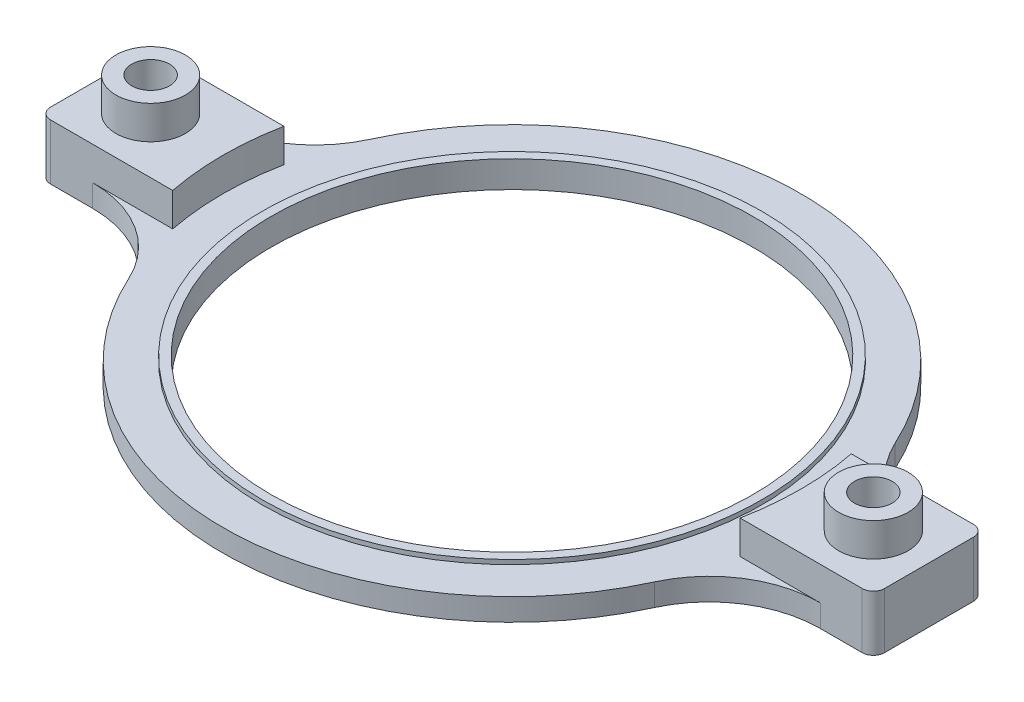
ISO-10303-21;
HEADER;
FILE_DESCRIPTION(('STEP AP214'),'2;1');
FILE_NAME('part.step','',(''),(''),'','','');
FILE_SCHEMA(('AUTOMOTIVE_DESIGN { 1 0 10303 214 1 1 1 1 }'));
ENDSEC;
DATA;
#1=APPLICATION_CONTEXT('core data for automotive mechanical design processes');
#2=APPLICATION_PROTOCOL_DEFINITION('international standard','automotive_design',2000,#1);
#3=PRODUCT_CONTEXT('',#1,'mechanical');
#4=PRODUCT('Part','Part','',(#3));
#5=PRODUCT_RELATED_PRODUCT_CATEGORY('part','',(#4));
#6=PRODUCT_DEFINITION_FORMATION('','',#4);
#7=PRODUCT_DEFINITION_CONTEXT('part definition',#1,'design');
#8=PRODUCT_DEFINITION('design','',#6,#7);
#9=PRODUCT_DEFINITION_SHAPE('','',#8);
#10=(LENGTH_UNIT() NAMED_UNIT(*) SI_UNIT(.MILLI.,.METRE.));
#11=(NAMED_UNIT(*) PLANE_ANGLE_UNIT() SI_UNIT($,.RADIAN.));
#12=(NAMED_UNIT(*) SI_UNIT($,.STERADIAN.) SOLID_ANGLE_UNIT());
#13=UNCERTAINTY_MEASURE_WITH_UNIT(LENGTH_MEASURE(1.E-05),#10,'distance_accuracy_value','');
#14=(GEOMETRIC_REPRESENTATION_CONTEXT(3) GLOBAL_UNCERTAINTY_ASSIGNED_CONTEXT((#13)) GLOBAL_UNIT_ASSIGNED_CONTEXT((#10,
#11,#12)) REPRESENTATION_CONTEXT('',''));
#15=CARTESIAN_POINT('',(0.,0.,0.));
#16=DIRECTION('',(0.,0.,1.));
#17=DIRECTION('',(1.,0.,0.));
#18=AXIS2_PLACEMENT_3D('',#15,#16,#17);
#19=CARTESIAN_POINT('',(0.,2.,0.));
#20=DIRECTION('',(0.,-1.,0.));
#21=DIRECTION('',(0.,0.,-1.));
#22=AXIS2_PLACEMENT_3D('',#19,#20,#21);
#23=CYLINDRICAL_SURFACE('',#22,26.);
#24=CARTESIAN_POINT('',(0.,0.,0.));
#25=DIRECTION('',(0.,1.,0.));
#26=DIRECTION('',(0.,0.,1.));
#27=AXIS2_PLACEMENT_3D('',#24,#25,#26);
#28=CIRCLE('',#27,26.);
#29=CARTESIAN_POINT('',(23.635542915044,0.,-10.8333333333333));
#30=VERTEX_POINT('',#29);
#31=CARTESIAN_POINT('',(-23.635542915044,0.,-10.8333333333333));
#32=VERTEX_POINT('',#31);
#33=EDGE_CURVE('E344',#30,#32,#28,.T.);
#34=ORIENTED_EDGE('',*,*,#33,.T.);
#35=DIRECTION('',(0.,-1.,0.));
#36=VECTOR('',#35,1.);
#37=CARTESIAN_POINT('',(-23.6355429150441,2.,-10.8333333333333));
#38=LINE('',#37,#36);
#39=CARTESIAN_POINT('',(-23.635542915044,2.,-10.8333333333333));
#40=VERTEX_POINT('',#39);
#41=EDGE_CURVE('E404',#32,#40,#38,.F.);
#42=ORIENTED_EDGE('',*,*,#41,.T.);
#43=CARTESIAN_POINT('',(0.,2.,0.));
#44=DIRECTION('',(0.,1.,0.));
#45=DIRECTION('',(0.,0.,1.));
#46=AXIS2_PLACEMENT_3D('',#43,#44,#45);
#47=CIRCLE('',#46,26.);
#48=CARTESIAN_POINT('',(23.635542915044,2.,-10.8333333333333));
#49=VERTEX_POINT('',#48);
#50=EDGE_CURVE('E342',#49,#40,#47,.T.);
#51=ORIENTED_EDGE('',*,*,#50,.F.);
#52=DIRECTION('',(0.,-1.,0.));
#53=VECTOR('',#52,1.);
#54=CARTESIAN_POINT('',(23.6355429150441,2.,-10.8333333333333));
#55=LINE('',#54,#53);
#56=EDGE_CURVE('E400',#49,#30,#55,.T.);
#57=ORIENTED_EDGE('',*,*,#56,.T.);
#58=EDGE_LOOP('',(#34,#42,#51,#57));
#59=FACE_BOUND('',#58,.T.);
#60=ADVANCED_FACE('F47',(#59),#23,.T.);
#61=CARTESIAN_POINT('',(-23.635542915044,2.,10.8333333333333));
#62=VERTEX_POINT('',#61);
#63=CARTESIAN_POINT('',(23.635542915044,2.,10.8333333333333));
#64=VERTEX_POINT('',#63);
#65=EDGE_CURVE('E348',#62,#64,#47,.T.);
#66=ORIENTED_EDGE('',*,*,#65,.F.);
#67=DIRECTION('',(0.,-1.,0.));
#68=VECTOR('',#67,1.);
#69=CARTESIAN_POINT('',(-23.6355429150441,2.,10.8333333333333));
#70=LINE('',#69,#68);
#71=CARTESIAN_POINT('',(-23.635542915044,0.,10.8333333333333));
#72=VERTEX_POINT('',#71);
#73=EDGE_CURVE('E391',#62,#72,#70,.T.);
#74=ORIENTED_EDGE('',*,*,#73,.T.);
#75=CARTESIAN_POINT('',(23.635542915044,0.,10.8333333333333));
#76=VERTEX_POINT('',#75);
#77=EDGE_CURVE('E339',#72,#76,#28,.T.);
#78=ORIENTED_EDGE('',*,*,#77,.T.);
#79=DIRECTION('',(0.,-1.,0.));
#80=VECTOR('',#79,1.);
#81=CARTESIAN_POINT('',(23.6355429150441,2.,10.8333333333333));
#82=LINE('',#81,#80);
#83=EDGE_CURVE('E387',#76,#64,#82,.F.);
#84=ORIENTED_EDGE('',*,*,#83,.T.);
#85=EDGE_LOOP('',(#66,#74,#78,#84));
#86=FACE_BOUND('',#85,.T.);
#87=ADVANCED_FACE('F450',(#86),#23,.T.);
#88=CARTESIAN_POINT('',(0.,2.,0.));
#89=DIRECTION('',(0.,1.,0.));
#90=DIRECTION('',(0.,0.,1.));
#91=AXIS2_PLACEMENT_3D('',#88,#89,#90);
#92=PLANE('',#91);
#93=CARTESIAN_POINT('',(25.5147016443462,2.,5.));
#94=VERTEX_POINT('',#93);
#95=CARTESIAN_POINT('',(25.5147016443462,2.,-5.));
#96=VERTEX_POINT('',#95);
#97=EDGE_CURVE('E260',#94,#96,#47,.T.);
#98=ORIENTED_EDGE('',*,*,#97,.T.);
#99=DIRECTION('',(-1.,0.,0.));
#100=VECTOR('',#99,1.);
#101=CARTESIAN_POINT('',(0.,2.,-5.));
#102=LINE('',#101,#100);
#103=CARTESIAN_POINT('',(32.7261363439072,2.,-5.));
#104=VERTEX_POINT('',#103);
#105=EDGE_CURVE('E407',#104,#96,#102,.T.);
#106=ORIENTED_EDGE('',*,*,#105,.F.);
#107=CARTESIAN_POINT('',(32.7261363439072,2.,-15.));
#108=DIRECTION('',(0.,1.,0.));
#109=DIRECTION('',(0.,0.,1.));
#110=AXIS2_PLACEMENT_3D('',#107,#108,#109);
#111=CIRCLE('',#110,10.);
#112=EDGE_CURVE('E430',#104,#49,#111,.F.);
#113=ORIENTED_EDGE('',*,*,#112,.T.);
#114=ORIENTED_EDGE('',*,*,#50,.T.);
#115=CARTESIAN_POINT('',(-32.7261363439072,2.,-15.));
#116=DIRECTION('',(0.,1.,0.));
#117=DIRECTION('',(0.,0.,1.));
#118=AXIS2_PLACEMENT_3D('',#115,#116,#117);
#119=CIRCLE('',#118,10.);
#120=CARTESIAN_POINT('',(-32.7261363439072,2.,-5.));
#121=VERTEX_POINT('',#120);
#122=EDGE_CURVE('E426',#40,#121,#119,.F.);
#123=ORIENTED_EDGE('',*,*,#122,.T.);
#124=DIRECTION('',(-1.,0.,0.));
#125=VECTOR('',#124,1.);
#126=CARTESIAN_POINT('',(-25.5147016443462,2.,-5.));
#127=LINE('',#126,#125);
#128=CARTESIAN_POINT('',(-25.5147016443462,2.,-5.));
#129=VERTEX_POINT('',#128);
#130=EDGE_CURVE('E70',#129,#121,#127,.T.);
#131=ORIENTED_EDGE('',*,*,#130,.F.);
#132=CARTESIAN_POINT('',(-25.5147016443462,2.,5.));
#133=VERTEX_POINT('',#132);
#134=EDGE_CURVE('E343',#129,#133,#47,.T.);
#135=ORIENTED_EDGE('',*,*,#134,.T.);
#136=DIRECTION('',(1.,0.,0.));
#137=VECTOR('',#136,1.);
#138=CARTESIAN_POINT('',(-25.5147016443462,2.,5.));
#139=LINE('',#138,#137);
#140=CARTESIAN_POINT('',(-32.7261363439072,2.,5.));
#141=VERTEX_POINT('',#140);
#142=EDGE_CURVE('E209',#141,#133,#139,.T.);
#143=ORIENTED_EDGE('',*,*,#142,.F.);
#144=CARTESIAN_POINT('',(-32.7261363439072,2.,15.));
#145=DIRECTION('',(0.,1.,0.));
#146=DIRECTION('',(0.,0.,1.));
#147=AXIS2_PLACEMENT_3D('',#144,#145,#146);
#148=CIRCLE('',#147,10.);
#149=EDGE_CURVE('E417',#141,#62,#148,.F.);
#150=ORIENTED_EDGE('',*,*,#149,.T.);
#151=ORIENTED_EDGE('',*,*,#65,.T.);
#152=CARTESIAN_POINT('',(32.7261363439072,2.,15.));
#153=DIRECTION('',(0.,1.,0.));
#154=DIRECTION('',(0.,0.,1.));
#155=AXIS2_PLACEMENT_3D('',#152,#153,#154);
#156=CIRCLE('',#155,10.);
#157=CARTESIAN_POINT('',(32.7261363439072,2.,5.));
#158=VERTEX_POINT('',#157);
#159=EDGE_CURVE('E56',#64,#158,#156,.F.);
#160=ORIENTED_EDGE('',*,*,#159,.T.);
#161=DIRECTION('',(1.,0.,0.));
#162=VECTOR('',#161,1.);
#163=CARTESIAN_POINT('',(0.,2.,5.));
#164=LINE('',#163,#162);
#165=EDGE_CURVE('E63',#94,#158,#164,.T.);
#166=ORIENTED_EDGE('',*,*,#165,.F.);
#167=EDGE_LOOP('',(#98,#106,#113,#114,#123,#131,#135,#143,#150,#151,#160,#166));
#168=FACE_BOUND('',#167,.T.);
#169=CARTESIAN_POINT('',(0.,2.,0.));
#170=DIRECTION('',(0.,1.,0.));
#171=DIRECTION('',(0.,0.,1.));
#172=AXIS2_PLACEMENT_3D('',#169,#170,#171);
#173=CIRCLE('',#172,22.475);
#174=CARTESIAN_POINT('',(0.,2.,22.475));
#175=VERTEX_POINT('',#174);
#176=EDGE_CURVE('E327',#175,#175,#173,.T.);
#177=ORIENTED_EDGE('',*,*,#176,.F.);
#178=EDGE_LOOP('',(#177));
#179=FACE_BOUND('',#178,.T.);
#180=ADVANCED_FACE('F434',(#168,#179),#92,.T.);
#181=CARTESIAN_POINT('',(0.,0.,0.));
#182=DIRECTION('',(0.,1.,0.));
#183=DIRECTION('',(0.,0.,1.));
#184=AXIS2_PLACEMENT_3D('',#181,#182,#183);
#185=PLANE('',#184);
#186=ORIENTED_EDGE('',*,*,#33,.F.);
#187=CARTESIAN_POINT('',(32.7261363439072,0.,-15.));
#188=DIRECTION('',(0.,1.,0.));
#189=DIRECTION('',(0.,0.,1.));
#190=AXIS2_PLACEMENT_3D('',#187,#188,#189);
#191=CIRCLE('',#190,10.);
#192=CARTESIAN_POINT('',(32.7261363439072,0.,-5.));
#193=VERTEX_POINT('',#192);
#194=EDGE_CURVE('E193',#30,#193,#191,.T.);
#195=ORIENTED_EDGE('',*,*,#194,.T.);
#196=DIRECTION('',(1.,0.,0.));
#197=VECTOR('',#196,1.);
#198=CARTESIAN_POINT('',(25.5147016443462,0.,-5.));
#199=LINE('',#198,#197);
#200=CARTESIAN_POINT('',(36.5000016443461,0.,-5.));
#201=VERTEX_POINT('',#200);
#202=EDGE_CURVE('E185',#193,#201,#199,.T.);
#203=ORIENTED_EDGE('',*,*,#202,.T.);
#204=CARTESIAN_POINT('',(36.5000016443461,0.,-4.));
#205=DIRECTION('',(0.,-1.,0.));
#206=DIRECTION('',(0.,0.,-1.));
#207=AXIS2_PLACEMENT_3D('',#204,#205,#206);
#208=CIRCLE('',#207,1.);
#209=CARTESIAN_POINT('',(37.5000016443461,0.,-4.));
#210=VERTEX_POINT('',#209);
#211=EDGE_CURVE('E192',#201,#210,#208,.T.);
#212=ORIENTED_EDGE('',*,*,#211,.T.);
#213=DIRECTION('',(0.,0.,1.));
#214=VECTOR('',#213,1.);
#215=CARTESIAN_POINT('',(37.5000016443461,0.,-4.));
#216=LINE('',#215,#214);
#217=CARTESIAN_POINT('',(37.5000016443461,0.,4.));
#218=VERTEX_POINT('',#217);
#219=EDGE_CURVE('E218',#210,#218,#216,.T.);
#220=ORIENTED_EDGE('',*,*,#219,.T.);
#221=CARTESIAN_POINT('',(36.5000016443461,0.,4.));
#222=DIRECTION('',(0.,-1.,0.));
#223=DIRECTION('',(0.,0.,-1.));
#224=AXIS2_PLACEMENT_3D('',#221,#222,#223);
#225=CIRCLE('',#224,1.);
#226=CARTESIAN_POINT('',(36.5000016443461,0.,5.));
#227=VERTEX_POINT('',#226);
#228=EDGE_CURVE('E227',#218,#227,#225,.T.);
#229=ORIENTED_EDGE('',*,*,#228,.T.);
#230=DIRECTION('',(-1.,0.,0.));
#231=VECTOR('',#230,1.);
#232=CARTESIAN_POINT('',(25.5147016443462,0.,5.));
#233=LINE('',#232,#231);
#234=CARTESIAN_POINT('',(32.7261363439072,0.,5.));
#235=VERTEX_POINT('',#234);
#236=EDGE_CURVE('E198',#227,#235,#233,.T.);
#237=ORIENTED_EDGE('',*,*,#236,.T.);
#238=CARTESIAN_POINT('',(32.7261363439072,0.,15.));
#239=DIRECTION('',(0.,1.,0.));
#240=DIRECTION('',(0.,0.,1.));
#241=AXIS2_PLACEMENT_3D('',#238,#239,#240);
#242=CIRCLE('',#241,10.);
#243=EDGE_CURVE('E11',#235,#76,#242,.T.);
#244=ORIENTED_EDGE('',*,*,#243,.T.);
#245=ORIENTED_EDGE('',*,*,#77,.F.);
#246=CARTESIAN_POINT('',(-32.7261363439072,0.,15.));
#247=DIRECTION('',(0.,1.,0.));
#248=DIRECTION('',(0.,0.,1.));
#249=AXIS2_PLACEMENT_3D('',#246,#247,#248);
#250=CIRCLE('',#249,10.);
#251=CARTESIAN_POINT('',(-32.7261363439072,0.,5.));
#252=VERTEX_POINT('',#251);
#253=EDGE_CURVE('E420',#72,#252,#250,.T.);
#254=ORIENTED_EDGE('',*,*,#253,.T.);
#255=DIRECTION('',(1.,0.,0.));
#256=VECTOR('',#255,1.);
#257=CARTESIAN_POINT('',(-25.5147016443462,0.,5.));
#258=LINE('',#257,#256);
#259=CARTESIAN_POINT('',(-36.5000016443461,0.,5.));
#260=VERTEX_POINT('',#259);
#261=EDGE_CURVE('E264',#260,#252,#258,.T.);
#262=ORIENTED_EDGE('',*,*,#261,.F.);
#263=CARTESIAN_POINT('',(-36.5000016443461,0.,4.));
#264=DIRECTION('',(0.,-1.,0.));
#265=DIRECTION('',(0.,0.,-1.));
#266=AXIS2_PLACEMENT_3D('',#263,#264,#265);
#267=CIRCLE('',#266,1.);
#268=CARTESIAN_POINT('',(-37.5000016443461,0.,4.));
#269=VERTEX_POINT('',#268);
#270=EDGE_CURVE('E234',#260,#269,#267,.T.);
#271=ORIENTED_EDGE('',*,*,#270,.T.);
#272=DIRECTION('',(0.,0.,-1.));
#273=VECTOR('',#272,1.);
#274=CARTESIAN_POINT('',(-37.5000016443461,0.,4.));
#275=LINE('',#274,#273);
#276=CARTESIAN_POINT('',(-37.5000016443461,0.,-4.));
#277=VERTEX_POINT('',#276);
#278=EDGE_CURVE('E238',#269,#277,#275,.T.);
#279=ORIENTED_EDGE('',*,*,#278,.T.);
#280=CARTESIAN_POINT('',(-36.5000016443461,0.,-4.));
#281=DIRECTION('',(0.,-1.,0.));
#282=DIRECTION('',(0.,0.,-1.));
#283=AXIS2_PLACEMENT_3D('',#280,#281,#282);
#284=CIRCLE('',#283,1.);
#285=CARTESIAN_POINT('',(-36.5000016443461,0.,-5.));
#286=VERTEX_POINT('',#285);
#287=EDGE_CURVE('E242',#277,#286,#284,.T.);
#288=ORIENTED_EDGE('',*,*,#287,.T.);
#289=DIRECTION('',(-1.,0.,0.));
#290=VECTOR('',#289,1.);
#291=CARTESIAN_POINT('',(-25.5147016443462,0.,-5.));
#292=LINE('',#291,#290);
#293=CARTESIAN_POINT('',(-32.7261363439072,0.,-5.));
#294=VERTEX_POINT('',#293);
#295=EDGE_CURVE('E270',#294,#286,#292,.T.);
#296=ORIENTED_EDGE('',*,*,#295,.F.);
#297=CARTESIAN_POINT('',(-32.7261363439072,0.,-15.));
#298=DIRECTION('',(0.,1.,0.));
#299=DIRECTION('',(0.,0.,1.));
#300=AXIS2_PLACEMENT_3D('',#297,#298,#299);
#301=CIRCLE('',#300,10.);
#302=EDGE_CURVE('E423',#294,#32,#301,.T.);
#303=ORIENTED_EDGE('',*,*,#302,.T.);
#304=EDGE_LOOP('',(#186,#195,#203,#212,#220,#229,#237,#244,#245,#254,#262,#271,#279,#288,#296,#303));
#305=FACE_BOUND('',#304,.T.);
#306=CARTESIAN_POINT('',(0.,0.,0.));
#307=DIRECTION('',(0.,1.,0.));
#308=DIRECTION('',(0.,0.,1.));
#309=AXIS2_PLACEMENT_3D('',#306,#307,#308);
#310=CIRCLE('',#309,21.675);
#311=CARTESIAN_POINT('',(0.,0.,21.675));
#312=VERTEX_POINT('',#311);
#313=EDGE_CURVE('E332',#312,#312,#310,.T.);
#314=ORIENTED_EDGE('',*,*,#313,.T.);
#315=EDGE_LOOP('',(#314));
#316=FACE_BOUND('',#315,.T.);
#317=CARTESIAN_POINT('',(-32.5000016443461,0.,0.));
#318=DIRECTION('',(0.,-1.,0.));
#319=DIRECTION('',(0.,0.,-1.));
#320=AXIS2_PLACEMENT_3D('',#317,#318,#319);
#321=CIRCLE('',#320,1.7);
#322=CARTESIAN_POINT('',(-32.5000016443461,0.,-1.7));
#323=VERTEX_POINT('',#322);
#324=EDGE_CURVE('E224',#323,#323,#321,.T.);
#325=ORIENTED_EDGE('',*,*,#324,.F.);
#326=EDGE_LOOP('',(#325));
#327=FACE_BOUND('',#326,.T.);
#328=CARTESIAN_POINT('',(32.5000016443461,0.,0.));
#329=DIRECTION('',(0.,-1.,0.));
#330=DIRECTION('',(0.,0.,-1.));
#331=AXIS2_PLACEMENT_3D('',#328,#329,#330);
#332=CIRCLE('',#331,1.7);
#333=CARTESIAN_POINT('',(32.5000016443461,0.,-1.7));
#334=VERTEX_POINT('',#333);
#335=EDGE_CURVE('E217',#334,#334,#332,.T.);
#336=ORIENTED_EDGE('',*,*,#335,.F.);
#337=EDGE_LOOP('',(#336));
#338=FACE_BOUND('',#337,.T.);
#339=ADVANCED_FACE('F188',(#305,#316,#327,#338),#185,.F.);
#340=CARTESIAN_POINT('',(0.,2.,0.));
#341=DIRECTION('',(0.,-1.,0.));
#342=DIRECTION('',(0.,0.,-1.));
#343=AXIS2_PLACEMENT_3D('',#340,#341,#342);
#344=CYLINDRICAL_SURFACE('',#343,21.675);
#345=ORIENTED_EDGE('',*,*,#313,.F.);
#346=EDGE_LOOP('',(#345));
#347=FACE_BOUND('',#346,.T.);
#348=CARTESIAN_POINT('',(0.,2.4,0.));
#349=DIRECTION('',(0.,1.,0.));
#350=DIRECTION('',(0.,0.,1.));
#351=AXIS2_PLACEMENT_3D('',#348,#349,#350);
#352=CIRCLE('',#351,21.675);
#353=CARTESIAN_POINT('',(0.,2.4,21.675));
#354=VERTEX_POINT('',#353);
#355=EDGE_CURVE('E320',#354,#354,#352,.T.);
#356=ORIENTED_EDGE('',*,*,#355,.T.);
#357=EDGE_LOOP('',(#356));
#358=FACE_BOUND('',#357,.T.);
#359=ADVANCED_FACE('F572',(#347,#358),#344,.F.);
#360=CARTESIAN_POINT('',(0.,2.4,0.));
#361=DIRECTION('',(0.,1.,0.));
#362=DIRECTION('',(0.,0.,1.));
#363=AXIS2_PLACEMENT_3D('',#360,#361,#362);
#364=PLANE('',#363);
#365=CARTESIAN_POINT('',(0.,2.4,0.));
#366=DIRECTION('',(0.,1.,0.));
#367=DIRECTION('',(0.,0.,1.));
#368=AXIS2_PLACEMENT_3D('',#365,#366,#367);
#369=CIRCLE('',#368,22.475);
#370=CARTESIAN_POINT('',(0.,2.4,22.475));
#371=VERTEX_POINT('',#370);
#372=EDGE_CURVE('E328',#371,#371,#369,.T.);
#373=ORIENTED_EDGE('',*,*,#372,.T.);
#374=EDGE_LOOP('',(#373));
#375=FACE_BOUND('',#374,.T.);
#376=ORIENTED_EDGE('',*,*,#355,.F.);
#377=EDGE_LOOP('',(#376));
#378=FACE_BOUND('',#377,.T.);
#379=ADVANCED_FACE('F569',(#375,#378),#364,.T.);
#380=CARTESIAN_POINT('',(0.,2.4,0.));
#381=DIRECTION('',(0.,-1.,0.));
#382=DIRECTION('',(0.,0.,-1.));
#383=AXIS2_PLACEMENT_3D('',#380,#381,#382);
#384=CYLINDRICAL_SURFACE('',#383,22.475);
#385=ORIENTED_EDGE('',*,*,#372,.F.);
#386=EDGE_LOOP('',(#385));
#387=FACE_BOUND('',#386,.T.);
#388=ORIENTED_EDGE('',*,*,#176,.T.);
#389=EDGE_LOOP('',(#388));
#390=FACE_BOUND('',#389,.T.);
#391=ADVANCED_FACE('F568',(#387,#390),#384,.T.);
#392=CARTESIAN_POINT('',(0.,5.,0.));
#393=DIRECTION('',(0.,-1.,0.));
#394=DIRECTION('',(0.,0.,-1.));
#395=AXIS2_PLACEMENT_3D('',#392,#393,#394);
#396=CYLINDRICAL_SURFACE('',#395,26.);
#397=DIRECTION('',(0.,-1.,0.));
#398=VECTOR('',#397,1.);
#399=CARTESIAN_POINT('',(25.5147016443462,5.,-5.));
#400=LINE('',#399,#398);
#401=CARTESIAN_POINT('',(25.5147016443462,5.,-5.));
#402=VERTEX_POINT('',#401);
#403=EDGE_CURVE('E312',#402,#96,#400,.T.);
#404=ORIENTED_EDGE('',*,*,#403,.T.);
#405=ORIENTED_EDGE('',*,*,#97,.F.);
#406=DIRECTION('',(0.,-1.,0.));
#407=VECTOR('',#406,1.);
#408=CARTESIAN_POINT('',(25.5147016443462,5.,5.));
#409=LINE('',#408,#407);
#410=CARTESIAN_POINT('',(25.5147016443462,5.,5.));
#411=VERTEX_POINT('',#410);
#412=EDGE_CURVE('E317',#411,#94,#409,.T.);
#413=ORIENTED_EDGE('',*,*,#412,.F.);
#414=CARTESIAN_POINT('',(0.,5.,0.));
#415=DIRECTION('',(0.,1.,0.));
#416=DIRECTION('',(0.,0.,-1.));
#417=AXIS2_PLACEMENT_3D('',#414,#415,#416);
#418=CIRCLE('',#417,26.);
#419=EDGE_CURVE('E304',#411,#402,#418,.T.);
#420=ORIENTED_EDGE('',*,*,#419,.T.);
#421=EDGE_LOOP('',(#404,#405,#413,#420));
#422=FACE_BOUND('',#421,.T.);
#423=ADVANCED_FACE('F536',(#422),#396,.F.);
#424=CARTESIAN_POINT('',(25.5147016443462,5.,5.));
#425=DIRECTION('',(0.,0.,1.));
#426=DIRECTION('',(1.,0.,0.));
#427=AXIS2_PLACEMENT_3D('',#424,#425,#426);
#428=PLANE('',#427);
#429=ORIENTED_EDGE('',*,*,#412,.T.);
#430=ORIENTED_EDGE('',*,*,#165,.T.);
#431=DIRECTION('',(0.,-1.,0.));
#432=VECTOR('',#431,1.);
#433=CARTESIAN_POINT('',(32.7261363439072,5.,5.));
#434=LINE('',#433,#432);
#435=EDGE_CURVE('E413',#158,#235,#434,.T.);
#436=ORIENTED_EDGE('',*,*,#435,.T.);
#437=ORIENTED_EDGE('',*,*,#236,.F.);
#438=DIRECTION('',(0.,-1.,0.));
#439=VECTOR('',#438,1.);
#440=CARTESIAN_POINT('',(36.5000016443461,5.,5.));
#441=LINE('',#440,#439);
#442=CARTESIAN_POINT('',(36.5000016443461,5.,5.));
#443=VERTEX_POINT('',#442);
#444=EDGE_CURVE('E373',#227,#443,#441,.F.);
#445=ORIENTED_EDGE('',*,*,#444,.T.);
#446=DIRECTION('',(-1.,0.,0.));
#447=VECTOR('',#446,1.);
#448=CARTESIAN_POINT('',(25.5147016443462,5.,5.));
#449=LINE('',#448,#447);
#450=EDGE_CURVE('E310',#443,#411,#449,.T.);
#451=ORIENTED_EDGE('',*,*,#450,.T.);
#452=EDGE_LOOP('',(#429,#430,#436,#437,#445,#451));
#453=FACE_BOUND('',#452,.T.);
#454=ADVANCED_FACE('F441',(#453),#428,.T.);
#455=CARTESIAN_POINT('',(25.5147016443462,5.,-5.));
#456=DIRECTION('',(0.,0.,-1.));
#457=DIRECTION('',(-1.,0.,0.));
#458=AXIS2_PLACEMENT_3D('',#455,#456,#457);
#459=PLANE('',#458);
#460=ORIENTED_EDGE('',*,*,#202,.F.);
#461=DIRECTION('',(0.,-1.,0.));
#462=VECTOR('',#461,1.);
#463=CARTESIAN_POINT('',(32.7261363439072,5.,-5.));
#464=LINE('',#463,#462);
#465=EDGE_CURVE('E410',#193,#104,#464,.F.);
#466=ORIENTED_EDGE('',*,*,#465,.T.);
#467=ORIENTED_EDGE('',*,*,#105,.T.);
#468=ORIENTED_EDGE('',*,*,#403,.F.);
#469=DIRECTION('',(1.,0.,0.));
#470=VECTOR('',#469,1.);
#471=CARTESIAN_POINT('',(25.5147016443462,5.,-5.));
#472=LINE('',#471,#470);
#473=CARTESIAN_POINT('',(36.5000016443461,5.,-5.));
#474=VERTEX_POINT('',#473);
#475=EDGE_CURVE('E206',#402,#474,#472,.T.);
#476=ORIENTED_EDGE('',*,*,#475,.T.);
#477=DIRECTION('',(0.,1.,0.));
#478=VECTOR('',#477,1.);
#479=CARTESIAN_POINT('',(36.5000016443461,5.,-5.));
#480=LINE('',#479,#478);
#481=EDGE_CURVE('E203',#474,#201,#480,.F.);
#482=ORIENTED_EDGE('',*,*,#481,.T.);
#483=EDGE_LOOP('',(#460,#466,#467,#468,#476,#482));
#484=FACE_BOUND('',#483,.T.);
#485=ADVANCED_FACE('F204',(#484),#459,.T.);
#486=CARTESIAN_POINT('',(0.,5.,0.));
#487=DIRECTION('',(0.,-1.,0.));
#488=DIRECTION('',(0.,0.,-1.));
#489=AXIS2_PLACEMENT_3D('',#486,#487,#488);
#490=PLANE('',#489);
#491=CARTESIAN_POINT('',(32.5000016443461,5.,0.));
#492=DIRECTION('',(0.,-1.,0.));
#493=DIRECTION('',(0.,0.,-1.));
#494=AXIS2_PLACEMENT_3D('',#491,#492,#493);
#495=CIRCLE('',#494,3.125);
#496=CARTESIAN_POINT('',(32.5000016443461,5.,-3.125));
#497=VERTEX_POINT('',#496);
#498=EDGE_CURVE('E297',#497,#497,#495,.T.);
#499=ORIENTED_EDGE('',*,*,#498,.T.);
#500=EDGE_LOOP('',(#499));
#501=FACE_BOUND('',#500,.T.);
#502=ORIENTED_EDGE('',*,*,#450,.F.);
#503=CARTESIAN_POINT('',(36.5000016443461,5.,4.));
#504=DIRECTION('',(0.,-1.,0.));
#505=DIRECTION('',(0.,0.,-1.));
#506=AXIS2_PLACEMENT_3D('',#503,#504,#505);
#507=CIRCLE('',#506,1.);
#508=CARTESIAN_POINT('',(37.5000016443461,5.,4.));
#509=VERTEX_POINT('',#508);
#510=EDGE_CURVE('E210',#443,#509,#507,.F.);
#511=ORIENTED_EDGE('',*,*,#510,.T.);
#512=DIRECTION('',(0.,0.,1.));
#513=VECTOR('',#512,1.);
#514=CARTESIAN_POINT('',(37.5000016443461,5.,-5.));
#515=LINE('',#514,#513);
#516=CARTESIAN_POINT('',(37.5000016443461,5.,-4.));
#517=VERTEX_POINT('',#516);
#518=EDGE_CURVE('E199',#517,#509,#515,.T.);
#519=ORIENTED_EDGE('',*,*,#518,.F.);
#520=CARTESIAN_POINT('',(36.5000016443461,5.,-4.));
#521=DIRECTION('',(0.,-1.,0.));
#522=DIRECTION('',(0.,0.,-1.));
#523=AXIS2_PLACEMENT_3D('',#520,#521,#522);
#524=CIRCLE('',#523,1.);
#525=EDGE_CURVE('E376',#517,#474,#524,.F.);
#526=ORIENTED_EDGE('',*,*,#525,.T.);
#527=ORIENTED_EDGE('',*,*,#475,.F.);
#528=ORIENTED_EDGE('',*,*,#419,.F.);
#529=EDGE_LOOP('',(#502,#511,#519,#526,#527,#528));
#530=FACE_BOUND('',#529,.T.);
#531=ADVANCED_FACE('F540',(#501,#530),#490,.F.);
#532=CARTESIAN_POINT('',(37.5000016443461,0.,0.));
#533=DIRECTION('',(1.,0.,0.));
#534=DIRECTION('',(0.,0.,-1.));
#535=AXIS2_PLACEMENT_3D('',#532,#533,#534);
#536=PLANE('',#535);
#537=ORIENTED_EDGE('',*,*,#518,.T.);
#538=DIRECTION('',(0.,-1.,0.));
#539=VECTOR('',#538,1.);
#540=CARTESIAN_POINT('',(37.5000016443461,0.,4.));
#541=LINE('',#540,#539);
#542=EDGE_CURVE('E370',#509,#218,#541,.T.);
#543=ORIENTED_EDGE('',*,*,#542,.T.);
#544=ORIENTED_EDGE('',*,*,#219,.F.);
#545=DIRECTION('',(0.,1.,0.));
#546=VECTOR('',#545,1.);
#547=CARTESIAN_POINT('',(37.5000016443461,0.,-4.));
#548=LINE('',#547,#546);
#549=EDGE_CURVE('E214',#210,#517,#548,.T.);
#550=ORIENTED_EDGE('',*,*,#549,.T.);
#551=EDGE_LOOP('',(#537,#543,#544,#550));
#552=FACE_BOUND('',#551,.T.);
#553=ADVANCED_FACE('F544',(#552),#536,.T.);
#554=CARTESIAN_POINT('',(32.5000016443461,8.,0.));
#555=DIRECTION('',(0.,-1.,0.));
#556=DIRECTION('',(0.,0.,-1.));
#557=AXIS2_PLACEMENT_3D('',#554,#555,#556);
#558=CYLINDRICAL_SURFACE('',#557,3.125);
#559=CARTESIAN_POINT('',(32.5000016443461,8.,0.));
#560=DIRECTION('',(0.,-1.,0.));
#561=DIRECTION('',(0.,0.,-1.));
#562=AXIS2_PLACEMENT_3D('',#559,#560,#561);
#563=CIRCLE('',#562,3.125);
#564=CARTESIAN_POINT('',(32.5000016443461,8.,-3.125));
#565=VERTEX_POINT('',#564);
#566=EDGE_CURVE('E293',#565,#565,#563,.T.);
#567=ORIENTED_EDGE('',*,*,#566,.T.);
#568=EDGE_LOOP('',(#567));
#569=FACE_BOUND('',#568,.T.);
#570=ORIENTED_EDGE('',*,*,#498,.F.);
#571=EDGE_LOOP('',(#570));
#572=FACE_BOUND('',#571,.T.);
#573=ADVANCED_FACE('F550',(#569,#572),#558,.T.);
#574=CARTESIAN_POINT('',(32.5000016443461,8.,0.));
#575=DIRECTION('',(0.,-1.,0.));
#576=DIRECTION('',(0.,0.,-1.));
#577=AXIS2_PLACEMENT_3D('',#574,#575,#576);
#578=PLANE('',#577);
#579=CARTESIAN_POINT('',(32.5000016443461,8.,0.));
#580=DIRECTION('',(0.,-1.,0.));
#581=DIRECTION('',(0.,0.,-1.));
#582=AXIS2_PLACEMENT_3D('',#579,#580,#581);
#583=CIRCLE('',#582,1.7);
#584=CARTESIAN_POINT('',(32.5000016443461,8.,-1.7));
#585=VERTEX_POINT('',#584);
#586=EDGE_CURVE('E286',#585,#585,#583,.T.);
#587=ORIENTED_EDGE('',*,*,#586,.T.);
#588=EDGE_LOOP('',(#587));
#589=FACE_BOUND('',#588,.T.);
#590=ORIENTED_EDGE('',*,*,#566,.F.);
#591=EDGE_LOOP('',(#590));
#592=FACE_BOUND('',#591,.T.);
#593=ADVANCED_FACE('F555',(#589,#592),#578,.F.);
#594=CARTESIAN_POINT('',(32.5000016443461,3.,0.));
#595=DIRECTION('',(0.,-1.,0.));
#596=DIRECTION('',(0.,0.,-1.));
#597=AXIS2_PLACEMENT_3D('',#594,#595,#596);
#598=CYLINDRICAL_SURFACE('',#597,1.7);
#599=ORIENTED_EDGE('',*,*,#586,.F.);
#600=EDGE_LOOP('',(#599));
#601=FACE_BOUND('',#600,.T.);
#602=ORIENTED_EDGE('',*,*,#335,.T.);
#603=EDGE_LOOP('',(#602));
#604=FACE_BOUND('',#603,.T.);
#605=ADVANCED_FACE('F633',(#601,#604),#598,.F.);
#606=CARTESIAN_POINT('',(0.,5.,0.));
#607=DIRECTION('',(0.,-1.,0.));
#608=DIRECTION('',(0.,0.,-1.));
#609=AXIS2_PLACEMENT_3D('',#606,#607,#608);
#610=CYLINDRICAL_SURFACE('',#609,26.);
#611=ORIENTED_EDGE('',*,*,#134,.F.);
#612=DIRECTION('',(0.,-1.,0.));
#613=VECTOR('',#612,1.);
#614=CARTESIAN_POINT('',(-25.5147016443462,5.,-5.));
#615=LINE('',#614,#613);
#616=CARTESIAN_POINT('',(-25.5147016443462,5.,-5.));
#617=VERTEX_POINT('',#616);
#618=EDGE_CURVE('E283',#617,#129,#615,.T.);
#619=ORIENTED_EDGE('',*,*,#618,.F.);
#620=CARTESIAN_POINT('',(0.,5.,0.));
#621=DIRECTION('',(0.,-1.,0.));
#622=DIRECTION('',(0.,0.,-1.));
#623=AXIS2_PLACEMENT_3D('',#620,#621,#622);
#624=CIRCLE('',#623,26.);
#625=CARTESIAN_POINT('',(-25.5147016443462,5.,5.));
#626=VERTEX_POINT('',#625);
#627=EDGE_CURVE('E265',#626,#617,#624,.T.);
#628=ORIENTED_EDGE('',*,*,#627,.F.);
#629=DIRECTION('',(0.,-1.,0.));
#630=VECTOR('',#629,1.);
#631=CARTESIAN_POINT('',(-25.5147016443462,5.,5.));
#632=LINE('',#631,#630);
#633=EDGE_CURVE('E277',#626,#133,#632,.T.);
#634=ORIENTED_EDGE('',*,*,#633,.T.);
#635=EDGE_LOOP('',(#611,#619,#628,#634));
#636=FACE_BOUND('',#635,.T.);
#637=ADVANCED_FACE('F485',(#636),#610,.F.);
#638=CARTESIAN_POINT('',(-25.5147016443462,5.,-5.));
#639=DIRECTION('',(0.,0.,1.));
#640=DIRECTION('',(1.,0.,0.));
#641=AXIS2_PLACEMENT_3D('',#638,#639,#640);
#642=PLANE('',#641);
#643=ORIENTED_EDGE('',*,*,#130,.T.);
#644=DIRECTION('',(0.,1.,0.));
#645=VECTOR('',#644,1.);
#646=CARTESIAN_POINT('',(-32.7261363439072,0.,-5.));
#647=LINE('',#646,#645);
#648=EDGE_CURVE('E396',#121,#294,#647,.F.);
#649=ORIENTED_EDGE('',*,*,#648,.T.);
#650=ORIENTED_EDGE('',*,*,#295,.T.);
#651=DIRECTION('',(0.,1.,0.));
#652=VECTOR('',#651,1.);
#653=CARTESIAN_POINT('',(-36.5000016443461,5.,-5.));
#654=LINE('',#653,#652);
#655=CARTESIAN_POINT('',(-36.5000016443461,5.,-5.));
#656=VERTEX_POINT('',#655);
#657=EDGE_CURVE('E259',#286,#656,#654,.T.);
#658=ORIENTED_EDGE('',*,*,#657,.T.);
#659=DIRECTION('',(-1.,0.,0.));
#660=VECTOR('',#659,1.);
#661=CARTESIAN_POINT('',(-25.5147016443462,5.,-5.));
#662=LINE('',#661,#660);
#663=EDGE_CURVE('E273',#617,#656,#662,.T.);
#664=ORIENTED_EDGE('',*,*,#663,.F.);
#665=ORIENTED_EDGE('',*,*,#618,.T.);
#666=EDGE_LOOP('',(#643,#649,#650,#658,#664,#665));
#667=FACE_BOUND('',#666,.T.);
#668=ADVANCED_FACE('F470',(#667),#642,.F.);
#669=CARTESIAN_POINT('',(-25.5147016443462,5.,5.));
#670=DIRECTION('',(0.,0.,-1.));
#671=DIRECTION('',(-1.,0.,0.));
#672=AXIS2_PLACEMENT_3D('',#669,#670,#671);
#673=PLANE('',#672);
#674=ORIENTED_EDGE('',*,*,#261,.T.);
#675=DIRECTION('',(0.,1.,0.));
#676=VECTOR('',#675,1.);
#677=CARTESIAN_POINT('',(-32.7261363439072,2.,5.));
#678=LINE('',#677,#676);
#679=EDGE_CURVE('E383',#252,#141,#678,.T.);
#680=ORIENTED_EDGE('',*,*,#679,.T.);
#681=ORIENTED_EDGE('',*,*,#142,.T.);
#682=ORIENTED_EDGE('',*,*,#633,.F.);
#683=DIRECTION('',(1.,0.,0.));
#684=VECTOR('',#683,1.);
#685=CARTESIAN_POINT('',(-25.5147016443462,5.,5.));
#686=LINE('',#685,#684);
#687=CARTESIAN_POINT('',(-36.5000016443461,5.,5.));
#688=VERTEX_POINT('',#687);
#689=EDGE_CURVE('E269',#688,#626,#686,.T.);
#690=ORIENTED_EDGE('',*,*,#689,.F.);
#691=DIRECTION('',(0.,-1.,0.));
#692=VECTOR('',#691,1.);
#693=CARTESIAN_POINT('',(-36.5000016443461,3.,5.));
#694=LINE('',#693,#692);
#695=EDGE_CURVE('E364',#688,#260,#694,.T.);
#696=ORIENTED_EDGE('',*,*,#695,.T.);
#697=EDGE_LOOP('',(#674,#680,#681,#682,#690,#696));
#698=FACE_BOUND('',#697,.T.);
#699=ADVANCED_FACE('F487',(#698),#673,.F.);
#700=CARTESIAN_POINT('',(0.,5.,0.));
#701=DIRECTION('',(0.,-1.,0.));
#702=DIRECTION('',(0.,0.,-1.));
#703=AXIS2_PLACEMENT_3D('',#700,#701,#702);
#704=PLANE('',#703);
#705=CARTESIAN_POINT('',(-32.5000016443461,5.,0.));
#706=DIRECTION('',(0.,-1.,0.));
#707=DIRECTION('',(0.,0.,-1.));
#708=AXIS2_PLACEMENT_3D('',#705,#706,#707);
#709=CIRCLE('',#708,3.125);
#710=CARTESIAN_POINT('',(-32.5000016443461,5.,-3.125));
#711=VERTEX_POINT('',#710);
#712=EDGE_CURVE('E255',#711,#711,#709,.F.);
#713=ORIENTED_EDGE('',*,*,#712,.F.);
#714=EDGE_LOOP('',(#713));
#715=FACE_BOUND('',#714,.T.);
#716=ORIENTED_EDGE('',*,*,#663,.T.);
#717=CARTESIAN_POINT('',(-36.5000016443461,5.,-4.));
#718=DIRECTION('',(0.,-1.,0.));
#719=DIRECTION('',(0.,0.,-1.));
#720=AXIS2_PLACEMENT_3D('',#717,#718,#719);
#721=CIRCLE('',#720,1.);
#722=CARTESIAN_POINT('',(-37.5000016443461,5.,-4.));
#723=VERTEX_POINT('',#722);
#724=EDGE_CURVE('E355',#656,#723,#721,.F.);
#725=ORIENTED_EDGE('',*,*,#724,.T.);
#726=DIRECTION('',(0.,0.,1.));
#727=VECTOR('',#726,1.);
#728=CARTESIAN_POINT('',(-37.5000016443461,5.,-5.));
#729=LINE('',#728,#727);
#730=CARTESIAN_POINT('',(-37.5000016443461,5.,4.));
#731=VERTEX_POINT('',#730);
#732=EDGE_CURVE('E254',#723,#731,#729,.T.);
#733=ORIENTED_EDGE('',*,*,#732,.T.);
#734=CARTESIAN_POINT('',(-36.5000016443461,5.,4.));
#735=DIRECTION('',(0.,-1.,0.));
#736=DIRECTION('',(0.,0.,-1.));
#737=AXIS2_PLACEMENT_3D('',#734,#735,#736);
#738=CIRCLE('',#737,1.);
#739=EDGE_CURVE('E352',#731,#688,#738,.F.);
#740=ORIENTED_EDGE('',*,*,#739,.T.);
#741=ORIENTED_EDGE('',*,*,#689,.T.);
#742=ORIENTED_EDGE('',*,*,#627,.T.);
#743=EDGE_LOOP('',(#716,#725,#733,#740,#741,#742));
#744=FACE_BOUND('',#743,.T.);
#745=ADVANCED_FACE('F478',(#715,#744),#704,.F.);
#746=CARTESIAN_POINT('',(-37.5000016443461,0.,0.));
#747=DIRECTION('',(-1.,0.,0.));
#748=DIRECTION('',(0.,0.,-1.));
#749=AXIS2_PLACEMENT_3D('',#746,#747,#748);
#750=PLANE('',#749);
#751=ORIENTED_EDGE('',*,*,#732,.F.);
#752=DIRECTION('',(0.,1.,0.));
#753=VECTOR('',#752,1.);
#754=CARTESIAN_POINT('',(-37.5000016443461,3.,-4.));
#755=LINE('',#754,#753);
#756=EDGE_CURVE('E361',#723,#277,#755,.F.);
#757=ORIENTED_EDGE('',*,*,#756,.T.);
#758=ORIENTED_EDGE('',*,*,#278,.F.);
#759=DIRECTION('',(0.,-1.,0.));
#760=VECTOR('',#759,1.);
#761=CARTESIAN_POINT('',(-37.5000016443461,5.,4.));
#762=LINE('',#761,#760);
#763=EDGE_CURVE('E358',#269,#731,#762,.F.);
#764=ORIENTED_EDGE('',*,*,#763,.T.);
#765=EDGE_LOOP('',(#751,#757,#758,#764));
#766=FACE_BOUND('',#765,.T.);
#767=ADVANCED_FACE('F497',(#766),#750,.T.);
#768=CARTESIAN_POINT('',(-32.5000016443461,8.,0.));
#769=DIRECTION('',(0.,-1.,0.));
#770=DIRECTION('',(0.,0.,-1.));
#771=AXIS2_PLACEMENT_3D('',#768,#769,#770);
#772=CYLINDRICAL_SURFACE('',#771,3.125);
#773=CARTESIAN_POINT('',(-32.5000016443461,8.,0.));
#774=DIRECTION('',(0.,1.,0.));
#775=DIRECTION('',(0.,0.,-1.));
#776=AXIS2_PLACEMENT_3D('',#773,#774,#775);
#777=CIRCLE('',#776,3.125);
#778=CARTESIAN_POINT('',(-32.5000016443461,8.,-3.125));
#779=VERTEX_POINT('',#778);
#780=EDGE_CURVE('E250',#779,#779,#777,.T.);
#781=ORIENTED_EDGE('',*,*,#780,.F.);
#782=EDGE_LOOP('',(#781));
#783=FACE_BOUND('',#782,.T.);
#784=ORIENTED_EDGE('',*,*,#712,.T.);
#785=EDGE_LOOP('',(#784));
#786=FACE_BOUND('',#785,.T.);
#787=ADVANCED_FACE('F499',(#783,#786),#772,.T.);
#788=CARTESIAN_POINT('',(-32.5000016443461,8.,0.));
#789=DIRECTION('',(0.,-1.,0.));
#790=DIRECTION('',(0.,0.,-1.));
#791=AXIS2_PLACEMENT_3D('',#788,#789,#790);
#792=PLANE('',#791);
#793=CARTESIAN_POINT('',(-32.5000016443461,8.,0.));
#794=DIRECTION('',(0.,-1.,0.));
#795=DIRECTION('',(0.,0.,-1.));
#796=AXIS2_PLACEMENT_3D('',#793,#794,#795);
#797=CIRCLE('',#796,1.7);
#798=CARTESIAN_POINT('',(-32.5000016443461,8.,-1.7));
#799=VERTEX_POINT('',#798);
#800=EDGE_CURVE('E246',#799,#799,#797,.T.);
#801=ORIENTED_EDGE('',*,*,#800,.T.);
#802=EDGE_LOOP('',(#801));
#803=FACE_BOUND('',#802,.T.);
#804=ORIENTED_EDGE('',*,*,#780,.T.);
#805=EDGE_LOOP('',(#804));
#806=FACE_BOUND('',#805,.T.);
#807=ADVANCED_FACE('F504',(#803,#806),#792,.F.);
#808=CARTESIAN_POINT('',(-32.5000016443461,3.,0.));
#809=DIRECTION('',(0.,-1.,0.));
#810=DIRECTION('',(0.,0.,-1.));
#811=AXIS2_PLACEMENT_3D('',#808,#809,#810);
#812=CYLINDRICAL_SURFACE('',#811,1.7);
#813=ORIENTED_EDGE('',*,*,#800,.F.);
#814=EDGE_LOOP('',(#813));
#815=FACE_BOUND('',#814,.T.);
#816=ORIENTED_EDGE('',*,*,#324,.T.);
#817=EDGE_LOOP('',(#816));
#818=FACE_BOUND('',#817,.T.);
#819=ADVANCED_FACE('F518',(#815,#818),#812,.F.);
#820=CARTESIAN_POINT('',(-36.5000016443461,5.,-4.));
#821=DIRECTION('',(0.,-1.,0.));
#822=DIRECTION('',(0.,0.,-1.));
#823=AXIS2_PLACEMENT_3D('',#820,#821,#822);
#824=CYLINDRICAL_SURFACE('',#823,1.);
#825=ORIENTED_EDGE('',*,*,#657,.F.);
#826=ORIENTED_EDGE('',*,*,#287,.F.);
#827=ORIENTED_EDGE('',*,*,#756,.F.);
#828=ORIENTED_EDGE('',*,*,#724,.F.);
#829=EDGE_LOOP('',(#825,#826,#827,#828));
#830=FACE_BOUND('',#829,.T.);
#831=ADVANCED_FACE('F476',(#830),#824,.T.);
#832=CARTESIAN_POINT('',(-36.5000016443461,5.,4.));
#833=DIRECTION('',(0.,1.,0.));
#834=DIRECTION('',(0.,0.,1.));
#835=AXIS2_PLACEMENT_3D('',#832,#833,#834);
#836=CYLINDRICAL_SURFACE('',#835,1.);
#837=ORIENTED_EDGE('',*,*,#739,.F.);
#838=ORIENTED_EDGE('',*,*,#763,.F.);
#839=ORIENTED_EDGE('',*,*,#270,.F.);
#840=ORIENTED_EDGE('',*,*,#695,.F.);
#841=EDGE_LOOP('',(#837,#838,#839,#840));
#842=FACE_BOUND('',#841,.T.);
#843=ADVANCED_FACE('F495',(#842),#836,.T.);
#844=CARTESIAN_POINT('',(36.5000016443461,0.,4.));
#845=DIRECTION('',(0.,-1.,0.));
#846=DIRECTION('',(0.,0.,-1.));
#847=AXIS2_PLACEMENT_3D('',#844,#845,#846);
#848=CYLINDRICAL_SURFACE('',#847,1.);
#849=ORIENTED_EDGE('',*,*,#510,.F.);
#850=ORIENTED_EDGE('',*,*,#444,.F.);
#851=ORIENTED_EDGE('',*,*,#228,.F.);
#852=ORIENTED_EDGE('',*,*,#542,.F.);
#853=EDGE_LOOP('',(#849,#850,#851,#852));
#854=FACE_BOUND('',#853,.T.);
#855=ADVANCED_FACE('F521',(#854),#848,.T.);
#856=CARTESIAN_POINT('',(36.5000016443461,0.,-4.));
#857=DIRECTION('',(0.,1.,0.));
#858=DIRECTION('',(0.,0.,1.));
#859=AXIS2_PLACEMENT_3D('',#856,#857,#858);
#860=CYLINDRICAL_SURFACE('',#859,1.);
#861=ORIENTED_EDGE('',*,*,#549,.F.);
#862=ORIENTED_EDGE('',*,*,#211,.F.);
#863=ORIENTED_EDGE('',*,*,#481,.F.);
#864=ORIENTED_EDGE('',*,*,#525,.F.);
#865=EDGE_LOOP('',(#861,#862,#863,#864));
#866=FACE_BOUND('',#865,.T.);
#867=ADVANCED_FACE('F212',(#866),#860,.T.);
#868=CARTESIAN_POINT('',(-32.7261363439072,2.,15.));
#869=DIRECTION('',(0.,-1.,0.));
#870=DIRECTION('',(0.,0.,-1.));
#871=AXIS2_PLACEMENT_3D('',#868,#869,#870);
#872=CYLINDRICAL_SURFACE('',#871,10.);
#873=ORIENTED_EDGE('',*,*,#253,.F.);
#874=ORIENTED_EDGE('',*,*,#73,.F.);
#875=ORIENTED_EDGE('',*,*,#149,.F.);
#876=ORIENTED_EDGE('',*,*,#679,.F.);
#877=EDGE_LOOP('',(#873,#874,#875,#876));
#878=FACE_BOUND('',#877,.T.);
#879=ADVANCED_FACE('F491',(#878),#872,.F.);
#880=CARTESIAN_POINT('',(-32.7261363439072,2.,-15.));
#881=DIRECTION('',(0.,-1.,0.));
#882=DIRECTION('',(0.,0.,-1.));
#883=AXIS2_PLACEMENT_3D('',#880,#881,#882);
#884=CYLINDRICAL_SURFACE('',#883,10.);
#885=ORIENTED_EDGE('',*,*,#122,.F.);
#886=ORIENTED_EDGE('',*,*,#41,.F.);
#887=ORIENTED_EDGE('',*,*,#302,.F.);
#888=ORIENTED_EDGE('',*,*,#648,.F.);
#889=EDGE_LOOP('',(#885,#886,#887,#888));
#890=FACE_BOUND('',#889,.T.);
#891=ADVANCED_FACE('F467',(#890),#884,.F.);
#892=CARTESIAN_POINT('',(32.7261363439072,2.,-15.));
#893=DIRECTION('',(0.,-1.,0.));
#894=DIRECTION('',(0.,0.,-1.));
#895=AXIS2_PLACEMENT_3D('',#892,#893,#894);
#896=CYLINDRICAL_SURFACE('',#895,10.);
#897=ORIENTED_EDGE('',*,*,#112,.F.);
#898=ORIENTED_EDGE('',*,*,#465,.F.);
#899=ORIENTED_EDGE('',*,*,#194,.F.);
#900=ORIENTED_EDGE('',*,*,#56,.F.);
#901=EDGE_LOOP('',(#897,#898,#899,#900));
#902=FACE_BOUND('',#901,.T.);
#903=ADVANCED_FACE('F530',(#902),#896,.F.);
#904=CARTESIAN_POINT('',(32.7261363439072,2.,15.));
#905=DIRECTION('',(0.,-1.,0.));
#906=DIRECTION('',(0.,0.,-1.));
#907=AXIS2_PLACEMENT_3D('',#904,#905,#906);
#908=CYLINDRICAL_SURFACE('',#907,10.);
#909=ORIENTED_EDGE('',*,*,#243,.F.);
#910=ORIENTED_EDGE('',*,*,#435,.F.);
#911=ORIENTED_EDGE('',*,*,#159,.F.);
#912=ORIENTED_EDGE('',*,*,#83,.F.);
#913=EDGE_LOOP('',(#909,#910,#911,#912));
#914=FACE_BOUND('',#913,.T.);
#915=ADVANCED_FACE('F49',(#914),#908,.F.);
#916=CLOSED_SHELL('',(#60,#87,#180,#339,#359,#379,#391,#423,#454,#485,#531,#553,#573,#593,#605,
#637,#668,#699,#745,#767,#787,#807,#819,#831,#843,#855,#867,#879,#891,#903,#915));
#917=MANIFOLD_SOLID_BREP('B2',#916);
#918=ADVANCED_BREP_SHAPE_REPRESENTATION('',(#18,#917),#14);
#919=SHAPE_DEFINITION_REPRESENTATION(#9,#918);
ENDSEC;
END-ISO-10303-21;
